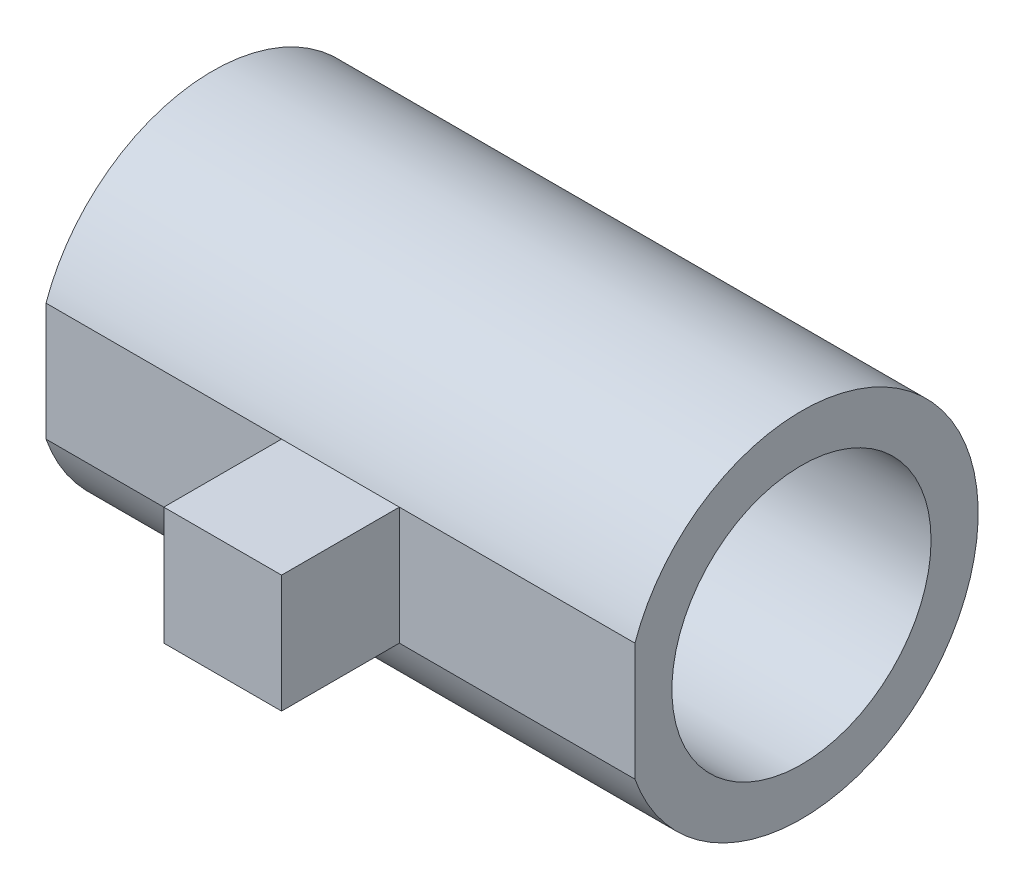
ISO-10303-21;
HEADER;
FILE_DESCRIPTION(('STEP AP214'),'2;1');
FILE_NAME('part.step','',(''),(''),'','','');
FILE_SCHEMA(('AUTOMOTIVE_DESIGN { 1 0 10303 214 1 1 1 1 }'));
ENDSEC;
DATA;
#1=APPLICATION_CONTEXT('core data for automotive mechanical design processes');
#2=APPLICATION_PROTOCOL_DEFINITION('international standard','automotive_design',2000,#1);
#3=PRODUCT_CONTEXT('',#1,'mechanical');
#4=PRODUCT('Part','Part','',(#3));
#5=PRODUCT_RELATED_PRODUCT_CATEGORY('part','',(#4));
#6=PRODUCT_DEFINITION_FORMATION('','',#4);
#7=PRODUCT_DEFINITION_CONTEXT('part definition',#1,'design');
#8=PRODUCT_DEFINITION('design','',#6,#7);
#9=PRODUCT_DEFINITION_SHAPE('','',#8);
#10=(LENGTH_UNIT() NAMED_UNIT(*) SI_UNIT(.MILLI.,.METRE.));
#11=(NAMED_UNIT(*) PLANE_ANGLE_UNIT() SI_UNIT($,.RADIAN.));
#12=(NAMED_UNIT(*) SI_UNIT($,.STERADIAN.) SOLID_ANGLE_UNIT());
#13=UNCERTAINTY_MEASURE_WITH_UNIT(LENGTH_MEASURE(1.E-05),#10,'distance_accuracy_value','');
#14=(GEOMETRIC_REPRESENTATION_CONTEXT(3) GLOBAL_UNCERTAINTY_ASSIGNED_CONTEXT((#13)) GLOBAL_UNIT_ASSIGNED_CONTEXT((#10,
#11,#12)) REPRESENTATION_CONTEXT('',''));
#15=CARTESIAN_POINT('',(0.,0.,0.));
#16=DIRECTION('',(0.,0.,1.));
#17=DIRECTION('',(1.,0.,0.));
#18=AXIS2_PLACEMENT_3D('',#15,#16,#17);
#19=CARTESIAN_POINT('',(50.,0.,0.));
#20=DIRECTION('',(1.,0.,0.));
#21=DIRECTION('',(0.,0.,-1.));
#22=AXIS2_PLACEMENT_3D('',#19,#20,#21);
#23=PLANE('',#22);
#24=DIRECTION('',(0.,-1.,0.));
#25=VECTOR('',#24,1.);
#26=CARTESIAN_POINT('',(50.,45.,14.142135623731));
#27=LINE('',#26,#25);
#28=CARTESIAN_POINT('',(50.,5.,14.142135623731));
#29=VERTEX_POINT('',#28);
#30=CARTESIAN_POINT('',(50.,-5.,14.142135623731));
#31=VERTEX_POINT('',#30);
#32=EDGE_CURVE('E112',#29,#31,#27,.T.);
#33=ORIENTED_EDGE('',*,*,#32,.T.);
#34=CARTESIAN_POINT('',(50.,0.,0.));
#35=DIRECTION('',(1.,0.,0.));
#36=DIRECTION('',(0.,0.,-1.));
#37=AXIS2_PLACEMENT_3D('',#34,#35,#36);
#38=CIRCLE('',#37,15.);
#39=EDGE_CURVE('E11',#31,#29,#38,.T.);
#40=ORIENTED_EDGE('',*,*,#39,.T.);
#41=EDGE_LOOP('',(#33,#40));
#42=FACE_BOUND('',#41,.T.);
#43=CARTESIAN_POINT('',(50.,0.,0.));
#44=DIRECTION('',(1.,0.,0.));
#45=DIRECTION('',(0.,0.,-1.));
#46=AXIS2_PLACEMENT_3D('',#43,#44,#45);
#47=CIRCLE('',#46,11.);
#48=CARTESIAN_POINT('',(50.,0.,-11.));
#49=VERTEX_POINT('',#48);
#50=EDGE_CURVE('E135',#49,#49,#47,.T.);
#51=ORIENTED_EDGE('',*,*,#50,.F.);
#52=EDGE_LOOP('',(#51));
#53=FACE_BOUND('',#52,.T.);
#54=ADVANCED_FACE('F39',(#42,#53),#23,.T.);
#55=CARTESIAN_POINT('',(0.,0.,0.));
#56=DIRECTION('',(1.,0.,0.));
#57=DIRECTION('',(0.,0.,-1.));
#58=AXIS2_PLACEMENT_3D('',#55,#56,#57);
#59=PLANE('',#58);
#60=CARTESIAN_POINT('',(0.,0.,0.));
#61=DIRECTION('',(1.,0.,0.));
#62=DIRECTION('',(0.,0.,-1.));
#63=AXIS2_PLACEMENT_3D('',#60,#61,#62);
#64=CIRCLE('',#63,15.);
#65=CARTESIAN_POINT('',(0.,-5.,14.142135623731));
#66=VERTEX_POINT('',#65);
#67=CARTESIAN_POINT('',(0.,5.,14.142135623731));
#68=VERTEX_POINT('',#67);
#69=EDGE_CURVE('E43',#66,#68,#64,.T.);
#70=ORIENTED_EDGE('',*,*,#69,.F.);
#71=DIRECTION('',(0.,-1.,0.));
#72=VECTOR('',#71,1.);
#73=CARTESIAN_POINT('',(0.,45.,14.142135623731));
#74=LINE('',#73,#72);
#75=EDGE_CURVE('E63',#68,#66,#74,.T.);
#76=ORIENTED_EDGE('',*,*,#75,.F.);
#77=EDGE_LOOP('',(#70,#76));
#78=FACE_BOUND('',#77,.T.);
#79=CARTESIAN_POINT('',(0.,0.,0.));
#80=DIRECTION('',(1.,0.,0.));
#81=DIRECTION('',(0.,0.,-1.));
#82=AXIS2_PLACEMENT_3D('',#79,#80,#81);
#83=CIRCLE('',#82,11.);
#84=CARTESIAN_POINT('',(0.,0.,-11.));
#85=VERTEX_POINT('',#84);
#86=EDGE_CURVE('E139',#85,#85,#83,.T.);
#87=ORIENTED_EDGE('',*,*,#86,.T.);
#88=EDGE_LOOP('',(#87));
#89=FACE_BOUND('',#88,.T.);
#90=ADVANCED_FACE('F189',(#78,#89),#59,.F.);
#91=CARTESIAN_POINT('',(50.,0.,0.));
#92=DIRECTION('',(-1.,0.,0.));
#93=DIRECTION('',(0.,0.,1.));
#94=AXIS2_PLACEMENT_3D('',#91,#92,#93);
#95=CYLINDRICAL_SURFACE('',#94,15.);
#96=ORIENTED_EDGE('',*,*,#69,.T.);
#97=DIRECTION('',(-1.,0.,0.));
#98=VECTOR('',#97,1.);
#99=CARTESIAN_POINT('',(50.,5.,14.142135623731));
#100=LINE('',#99,#98);
#101=CARTESIAN_POINT('',(20.,5.,14.142135623731));
#102=VERTEX_POINT('',#101);
#103=EDGE_CURVE('E130',#102,#68,#100,.T.);
#104=ORIENTED_EDGE('',*,*,#103,.F.);
#105=DIRECTION('',(-1.,0.,0.));
#106=VECTOR('',#105,1.);
#107=CARTESIAN_POINT('',(50.,5.,14.142135623731));
#108=LINE('',#107,#106);
#109=CARTESIAN_POINT('',(30.,5.,14.142135623731));
#110=VERTEX_POINT('',#109);
#111=EDGE_CURVE('E146',#110,#102,#108,.T.);
#112=ORIENTED_EDGE('',*,*,#111,.F.);
#113=EDGE_CURVE('E142',#29,#110,#108,.T.);
#114=ORIENTED_EDGE('',*,*,#113,.F.);
#115=ORIENTED_EDGE('',*,*,#39,.F.);
#116=DIRECTION('',(-1.,0.,0.));
#117=VECTOR('',#116,1.);
#118=CARTESIAN_POINT('',(50.,-5.,14.142135623731));
#119=LINE('',#118,#117);
#120=CARTESIAN_POINT('',(30.,-5.,14.142135623731));
#121=VERTEX_POINT('',#120);
#122=EDGE_CURVE('E125',#31,#121,#119,.T.);
#123=ORIENTED_EDGE('',*,*,#122,.T.);
#124=CARTESIAN_POINT('',(20.,-5.,14.142135623731));
#125=VERTEX_POINT('',#124);
#126=EDGE_CURVE('E118',#121,#125,#119,.T.);
#127=ORIENTED_EDGE('',*,*,#126,.T.);
#128=DIRECTION('',(1.,0.,0.));
#129=VECTOR('',#128,1.);
#130=CARTESIAN_POINT('',(0.,-5.,14.142135623731));
#131=LINE('',#130,#129);
#132=EDGE_CURVE('E105',#66,#125,#131,.T.);
#133=ORIENTED_EDGE('',*,*,#132,.F.);
#134=EDGE_LOOP('',(#96,#104,#112,#114,#115,#123,#127,#133));
#135=FACE_BOUND('',#134,.T.);
#136=ADVANCED_FACE('F41',(#135),#95,.T.);
#137=CARTESIAN_POINT('',(50.,0.,0.));
#138=DIRECTION('',(-1.,0.,0.));
#139=DIRECTION('',(0.,0.,1.));
#140=AXIS2_PLACEMENT_3D('',#137,#138,#139);
#141=CYLINDRICAL_SURFACE('',#140,11.);
#142=ORIENTED_EDGE('',*,*,#50,.T.);
#143=EDGE_LOOP('',(#142));
#144=FACE_BOUND('',#143,.T.);
#145=ORIENTED_EDGE('',*,*,#86,.F.);
#146=EDGE_LOOP('',(#145));
#147=FACE_BOUND('',#146,.T.);
#148=ADVANCED_FACE('F193',(#144,#147),#141,.F.);
#149=CARTESIAN_POINT('',(50.,5.,14.142135623731));
#150=DIRECTION('',(0.,1.,0.));
#151=DIRECTION('',(0.,0.,1.));
#152=AXIS2_PLACEMENT_3D('',#149,#150,#151);
#153=PLANE('',#152);
#154=DIRECTION('',(0.,0.,-1.));
#155=VECTOR('',#154,1.);
#156=CARTESIAN_POINT('',(20.,5.,14.142135623731));
#157=LINE('',#156,#155);
#158=CARTESIAN_POINT('',(20.,5.,24.142135623731));
#159=VERTEX_POINT('',#158);
#160=EDGE_CURVE('E100',#159,#102,#157,.T.);
#161=ORIENTED_EDGE('',*,*,#160,.F.);
#162=DIRECTION('',(-1.,0.,0.));
#163=VECTOR('',#162,1.);
#164=CARTESIAN_POINT('',(50.,5.,24.142135623731));
#165=LINE('',#164,#163);
#166=CARTESIAN_POINT('',(30.,5.,24.142135623731));
#167=VERTEX_POINT('',#166);
#168=EDGE_CURVE('E153',#167,#159,#165,.T.);
#169=ORIENTED_EDGE('',*,*,#168,.F.);
#170=DIRECTION('',(0.,0.,1.));
#171=VECTOR('',#170,1.);
#172=CARTESIAN_POINT('',(30.,5.,14.1421356237309));
#173=LINE('',#172,#171);
#174=EDGE_CURVE('E164',#110,#167,#173,.T.);
#175=ORIENTED_EDGE('',*,*,#174,.F.);
#176=ORIENTED_EDGE('',*,*,#111,.T.);
#177=EDGE_LOOP('',(#161,#169,#175,#176));
#178=FACE_BOUND('',#177,.T.);
#179=ADVANCED_FACE('F163',(#178),#153,.T.);
#180=CARTESIAN_POINT('',(50.,5.,24.142135623731));
#181=DIRECTION('',(0.,0.,1.));
#182=DIRECTION('',(1.,0.,0.));
#183=AXIS2_PLACEMENT_3D('',#180,#181,#182);
#184=PLANE('',#183);
#185=DIRECTION('',(0.,-1.,0.));
#186=VECTOR('',#185,1.);
#187=CARTESIAN_POINT('',(20.,45.,24.142135623731));
#188=LINE('',#187,#186);
#189=CARTESIAN_POINT('',(20.,-5.,24.142135623731));
#190=VERTEX_POINT('',#189);
#191=EDGE_CURVE('E103',#159,#190,#188,.T.);
#192=ORIENTED_EDGE('',*,*,#191,.T.);
#193=DIRECTION('',(-1.,0.,0.));
#194=VECTOR('',#193,1.);
#195=CARTESIAN_POINT('',(50.,-5.,24.142135623731));
#196=LINE('',#195,#194);
#197=CARTESIAN_POINT('',(30.,-5.,24.142135623731));
#198=VERTEX_POINT('',#197);
#199=EDGE_CURVE('E121',#198,#190,#196,.T.);
#200=ORIENTED_EDGE('',*,*,#199,.F.);
#201=DIRECTION('',(0.,-1.,0.));
#202=VECTOR('',#201,1.);
#203=CARTESIAN_POINT('',(30.,45.,24.142135623731));
#204=LINE('',#203,#202);
#205=EDGE_CURVE('E55',#167,#198,#204,.T.);
#206=ORIENTED_EDGE('',*,*,#205,.F.);
#207=ORIENTED_EDGE('',*,*,#168,.T.);
#208=EDGE_LOOP('',(#192,#200,#206,#207));
#209=FACE_BOUND('',#208,.T.);
#210=ADVANCED_FACE('F160',(#209),#184,.T.);
#211=CARTESIAN_POINT('',(50.,-5.,14.142135623731));
#212=DIRECTION('',(0.,-1.,0.));
#213=DIRECTION('',(0.,0.,-1.));
#214=AXIS2_PLACEMENT_3D('',#211,#212,#213);
#215=PLANE('',#214);
#216=DIRECTION('',(0.,0.,1.));
#217=VECTOR('',#216,1.);
#218=CARTESIAN_POINT('',(20.,-5.,24.142135623731));
#219=LINE('',#218,#217);
#220=EDGE_CURVE('E97',#125,#190,#219,.T.);
#221=ORIENTED_EDGE('',*,*,#220,.F.);
#222=ORIENTED_EDGE('',*,*,#126,.F.);
#223=DIRECTION('',(0.,0.,-1.));
#224=VECTOR('',#223,1.);
#225=CARTESIAN_POINT('',(30.,-5.,14.142135623731));
#226=LINE('',#225,#224);
#227=EDGE_CURVE('E173',#198,#121,#226,.T.);
#228=ORIENTED_EDGE('',*,*,#227,.F.);
#229=ORIENTED_EDGE('',*,*,#199,.T.);
#230=EDGE_LOOP('',(#221,#222,#228,#229));
#231=FACE_BOUND('',#230,.T.);
#232=ADVANCED_FACE('F117',(#231),#215,.T.);
#233=CARTESIAN_POINT('',(50.,45.,14.142135623731));
#234=DIRECTION('',(0.,0.,-1.));
#235=DIRECTION('',(-1.,0.,0.));
#236=AXIS2_PLACEMENT_3D('',#233,#234,#235);
#237=PLANE('',#236);
#238=ORIENTED_EDGE('',*,*,#113,.T.);
#239=DIRECTION('',(0.,-1.,0.));
#240=VECTOR('',#239,1.);
#241=CARTESIAN_POINT('',(30.,45.,14.142135623731));
#242=LINE('',#241,#240);
#243=EDGE_CURVE('E172',#110,#121,#242,.T.);
#244=ORIENTED_EDGE('',*,*,#243,.T.);
#245=ORIENTED_EDGE('',*,*,#122,.F.);
#246=ORIENTED_EDGE('',*,*,#32,.F.);
#247=EDGE_LOOP('',(#238,#244,#245,#246));
#248=FACE_BOUND('',#247,.T.);
#249=ADVANCED_FACE('F185',(#248),#237,.F.);
#250=CARTESIAN_POINT('',(30.,45.,14.142135623731));
#251=DIRECTION('',(-1.,0.,0.));
#252=DIRECTION('',(0.,0.,1.));
#253=AXIS2_PLACEMENT_3D('',#250,#251,#252);
#254=PLANE('',#253);
#255=ORIENTED_EDGE('',*,*,#174,.T.);
#256=ORIENTED_EDGE('',*,*,#205,.T.);
#257=ORIENTED_EDGE('',*,*,#227,.T.);
#258=ORIENTED_EDGE('',*,*,#243,.F.);
#259=EDGE_LOOP('',(#255,#256,#257,#258));
#260=FACE_BOUND('',#259,.T.);
#261=ADVANCED_FACE('F184',(#260),#254,.F.);
#262=CARTESIAN_POINT('',(20.,45.,24.142135623731));
#263=DIRECTION('',(1.,0.,0.));
#264=DIRECTION('',(0.,0.,-1.));
#265=AXIS2_PLACEMENT_3D('',#262,#263,#264);
#266=PLANE('',#265);
#267=ORIENTED_EDGE('',*,*,#160,.T.);
#268=DIRECTION('',(0.,-1.,0.));
#269=VECTOR('',#268,1.);
#270=CARTESIAN_POINT('',(20.,45.,14.142135623731));
#271=LINE('',#270,#269);
#272=EDGE_CURVE('E94',#102,#125,#271,.T.);
#273=ORIENTED_EDGE('',*,*,#272,.T.);
#274=ORIENTED_EDGE('',*,*,#220,.T.);
#275=ORIENTED_EDGE('',*,*,#191,.F.);
#276=EDGE_LOOP('',(#267,#273,#274,#275));
#277=FACE_BOUND('',#276,.T.);
#278=ADVANCED_FACE('F95',(#277),#266,.F.);
#279=CARTESIAN_POINT('',(0.,45.,14.142135623731));
#280=DIRECTION('',(0.,0.,-1.));
#281=DIRECTION('',(-1.,0.,0.));
#282=AXIS2_PLACEMENT_3D('',#279,#280,#281);
#283=PLANE('',#282);
#284=ORIENTED_EDGE('',*,*,#103,.T.);
#285=ORIENTED_EDGE('',*,*,#75,.T.);
#286=ORIENTED_EDGE('',*,*,#132,.T.);
#287=ORIENTED_EDGE('',*,*,#272,.F.);
#288=EDGE_LOOP('',(#284,#285,#286,#287));
#289=FACE_BOUND('',#288,.T.);
#290=ADVANCED_FACE('F106',(#289),#283,.F.);
#291=CLOSED_SHELL('',(#54,#90,#136,#148,#179,#210,#232,#249,#261,#278,#290));
#292=MANIFOLD_SOLID_BREP('B2',#291);
#293=ADVANCED_BREP_SHAPE_REPRESENTATION('',(#18,#292),#14);
#294=SHAPE_DEFINITION_REPRESENTATION(#9,#293);
ENDSEC;
END-ISO-10303-21;
